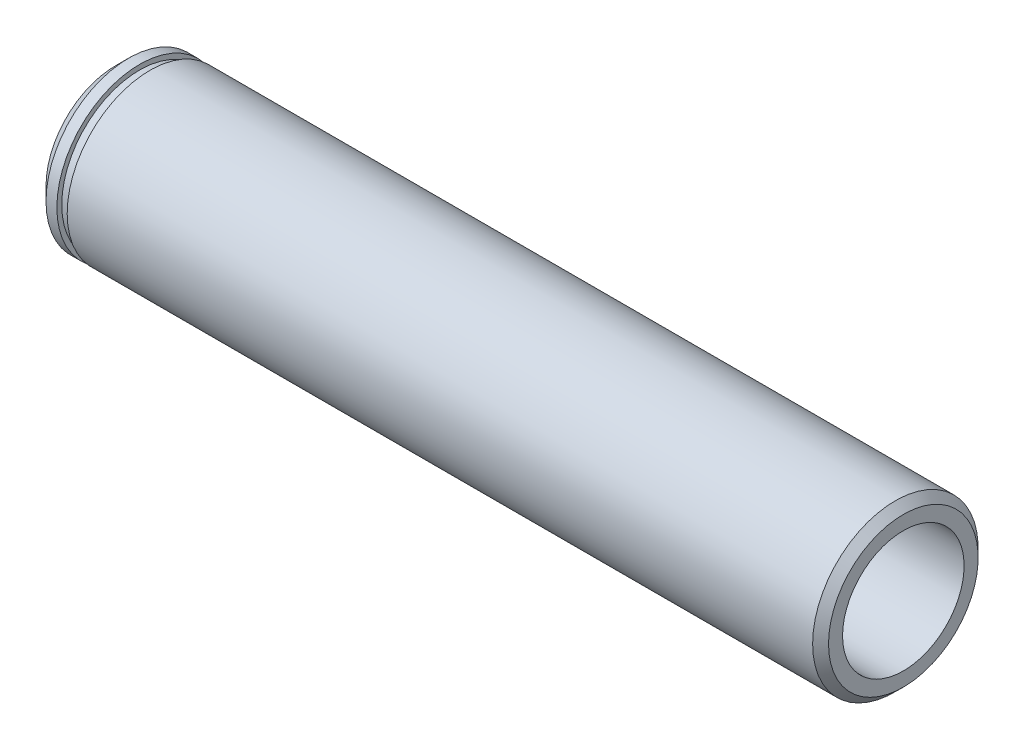
ISO-10303-21;
HEADER;
FILE_DESCRIPTION(('STEP AP214'),'2;1');
FILE_NAME('part.step','',(''),(''),'','','');
FILE_SCHEMA(('AUTOMOTIVE_DESIGN { 1 0 10303 214 1 1 1 1 }'));
ENDSEC;
DATA;
#1=APPLICATION_CONTEXT('core data for automotive mechanical design processes');
#2=APPLICATION_PROTOCOL_DEFINITION('international standard','automotive_design',2000,#1);
#3=PRODUCT_CONTEXT('',#1,'mechanical');
#4=PRODUCT('Part','Part','',(#3));
#5=PRODUCT_RELATED_PRODUCT_CATEGORY('part','',(#4));
#6=PRODUCT_DEFINITION_FORMATION('','',#4);
#7=PRODUCT_DEFINITION_CONTEXT('part definition',#1,'design');
#8=PRODUCT_DEFINITION('design','',#6,#7);
#9=PRODUCT_DEFINITION_SHAPE('','',#8);
#10=(LENGTH_UNIT() NAMED_UNIT(*) SI_UNIT(.MILLI.,.METRE.));
#11=(NAMED_UNIT(*) PLANE_ANGLE_UNIT() SI_UNIT($,.RADIAN.));
#12=(NAMED_UNIT(*) SI_UNIT($,.STERADIAN.) SOLID_ANGLE_UNIT());
#13=UNCERTAINTY_MEASURE_WITH_UNIT(LENGTH_MEASURE(1.E-05),#10,'distance_accuracy_value','');
#14=(GEOMETRIC_REPRESENTATION_CONTEXT(3) GLOBAL_UNCERTAINTY_ASSIGNED_CONTEXT((#13)) GLOBAL_UNIT_ASSIGNED_CONTEXT((#10,
#11,#12)) REPRESENTATION_CONTEXT('',''));
#15=CARTESIAN_POINT('',(0.,0.,0.));
#16=DIRECTION('',(0.,0.,1.));
#17=DIRECTION('',(1.,0.,0.));
#18=AXIS2_PLACEMENT_3D('',#15,#16,#17);
#19=CARTESIAN_POINT('',(75.565,0.,0.));
#20=DIRECTION('',(-1.,0.,0.));
#21=DIRECTION('',(0.,0.,1.));
#22=AXIS2_PLACEMENT_3D('',#19,#20,#21);
#23=CYLINDRICAL_SURFACE('',#22,5.99440000000121);
#24=CARTESIAN_POINT('',(0.,0.,0.));
#25=DIRECTION('',(-1.,0.,0.));
#26=DIRECTION('',(0.,0.,1.));
#27=AXIS2_PLACEMENT_3D('',#24,#25,#26);
#28=CIRCLE('',#27,5.99440000000121);
#29=CARTESIAN_POINT('',(0.,0.,5.99440000000121));
#30=VERTEX_POINT('',#29);
#31=EDGE_CURVE('E10',#30,#30,#28,.T.);
#32=ORIENTED_EDGE('',*,*,#31,.T.);
#33=EDGE_LOOP('',(#32));
#34=FACE_BOUND('',#33,.T.);
#35=CARTESIAN_POINT('',(8.88999999999998,0.,0.));
#36=DIRECTION('',(-1.,0.,0.));
#37=DIRECTION('',(0.,0.,1.));
#38=AXIS2_PLACEMENT_3D('',#35,#36,#37);
#39=CIRCLE('',#38,5.99440000000121);
#40=CARTESIAN_POINT('',(8.88999999999998,0.,5.99440000000121));
#41=VERTEX_POINT('',#40);
#42=EDGE_CURVE('E75',#41,#41,#39,.T.);
#43=ORIENTED_EDGE('',*,*,#42,.F.);
#44=EDGE_LOOP('',(#43));
#45=FACE_BOUND('',#44,.T.);
#46=ADVANCED_FACE('F34',(#34,#45),#23,.F.);
#47=CARTESIAN_POINT('',(-2.39391839684799E-13,5.99440000000121,0.));
#48=DIRECTION('',(-1.,0.,0.));
#49=DIRECTION('',(0.,0.,1.));
#50=AXIS2_PLACEMENT_3D('',#47,#48,#49);
#51=PLANE('',#50);
#52=CARTESIAN_POINT('',(-4.71844785465692E-13,0.,0.));
#53=DIRECTION('',(-1.,0.,0.));
#54=DIRECTION('',(0.,0.,1.));
#55=AXIS2_PLACEMENT_3D('',#52,#53,#54);
#56=CIRCLE('',#55,6.66750000000047);
#57=CARTESIAN_POINT('',(-4.71844785465692E-13,0.,6.66750000000047));
#58=VERTEX_POINT('',#57);
#59=EDGE_CURVE('E40',#58,#58,#56,.T.);
#60=ORIENTED_EDGE('',*,*,#59,.T.);
#61=EDGE_LOOP('',(#60));
#62=FACE_BOUND('',#61,.T.);
#63=ORIENTED_EDGE('',*,*,#31,.F.);
#64=EDGE_LOOP('',(#63));
#65=FACE_BOUND('',#64,.T.);
#66=ADVANCED_FACE('F83',(#62,#65),#51,.T.);
#67=CARTESIAN_POINT('',(-4.71844785465692E-13,0.,0.));
#68=DIRECTION('',(1.,0.,0.));
#69=DIRECTION('',(0.,0.,-1.));
#70=AXIS2_PLACEMENT_3D('',#67,#68,#69);
#71=CONICAL_SURFACE('',#70,6.66750000000047,0.785398163397078);
#72=CARTESIAN_POINT('',(1.26999999999999,0.,0.));
#73=DIRECTION('',(-1.,0.,0.));
#74=DIRECTION('',(0.,0.,1.));
#75=AXIS2_PLACEMENT_3D('',#72,#73,#74);
#76=CIRCLE('',#75,7.9375);
#77=CARTESIAN_POINT('',(1.26999999999999,0.,7.9375));
#78=VERTEX_POINT('',#77);
#79=EDGE_CURVE('E44',#78,#78,#76,.T.);
#80=ORIENTED_EDGE('',*,*,#79,.T.);
#81=EDGE_LOOP('',(#80));
#82=FACE_BOUND('',#81,.T.);
#83=ORIENTED_EDGE('',*,*,#59,.F.);
#84=EDGE_LOOP('',(#83));
#85=FACE_BOUND('',#84,.T.);
#86=ADVANCED_FACE('F87',(#82,#85),#71,.T.);
#87=CARTESIAN_POINT('',(75.565,0.,0.));
#88=DIRECTION('',(-1.,0.,0.));
#89=DIRECTION('',(0.,0.,1.));
#90=AXIS2_PLACEMENT_3D('',#87,#88,#89);
#91=CYLINDRICAL_SURFACE('',#90,7.9375);
#92=CARTESIAN_POINT('',(2.31140000000001,0.,0.));
#93=DIRECTION('',(-1.,0.,0.));
#94=DIRECTION('',(0.,0.,1.));
#95=AXIS2_PLACEMENT_3D('',#92,#93,#94);
#96=CIRCLE('',#95,7.9375);
#97=CARTESIAN_POINT('',(2.31140000000001,0.,7.9375));
#98=VERTEX_POINT('',#97);
#99=EDGE_CURVE('E48',#98,#98,#96,.T.);
#100=ORIENTED_EDGE('',*,*,#99,.T.);
#101=EDGE_LOOP('',(#100));
#102=FACE_BOUND('',#101,.T.);
#103=ORIENTED_EDGE('',*,*,#79,.F.);
#104=EDGE_LOOP('',(#103));
#105=FACE_BOUND('',#104,.T.);
#106=ADVANCED_FACE('F91',(#102,#105),#91,.T.);
#107=CARTESIAN_POINT('',(2.3114,7.9375,0.));
#108=DIRECTION('',(1.,0.,0.));
#109=DIRECTION('',(0.,0.,-1.));
#110=AXIS2_PLACEMENT_3D('',#107,#108,#109);
#111=PLANE('',#110);
#112=CARTESIAN_POINT('',(2.31140000000001,0.,0.));
#113=DIRECTION('',(-1.,0.,0.));
#114=DIRECTION('',(0.,0.,1.));
#115=AXIS2_PLACEMENT_3D('',#112,#113,#114);
#116=CIRCLE('',#115,7.4676);
#117=CARTESIAN_POINT('',(2.31140000000001,0.,7.4676));
#118=VERTEX_POINT('',#117);
#119=EDGE_CURVE('E53',#118,#118,#116,.T.);
#120=ORIENTED_EDGE('',*,*,#119,.T.);
#121=EDGE_LOOP('',(#120));
#122=FACE_BOUND('',#121,.T.);
#123=ORIENTED_EDGE('',*,*,#99,.F.);
#124=EDGE_LOOP('',(#123));
#125=FACE_BOUND('',#124,.T.);
#126=ADVANCED_FACE('F98',(#122,#125),#111,.T.);
#127=CARTESIAN_POINT('',(75.565,0.,0.));
#128=DIRECTION('',(-1.,0.,0.));
#129=DIRECTION('',(0.,0.,1.));
#130=AXIS2_PLACEMENT_3D('',#127,#128,#129);
#131=CYLINDRICAL_SURFACE('',#130,7.4676);
#132=CARTESIAN_POINT('',(3.302,0.,0.));
#133=DIRECTION('',(-1.,0.,0.));
#134=DIRECTION('',(0.,0.,1.));
#135=AXIS2_PLACEMENT_3D('',#132,#133,#134);
#136=CIRCLE('',#135,7.4676);
#137=CARTESIAN_POINT('',(3.302,0.,7.4676));
#138=VERTEX_POINT('',#137);
#139=EDGE_CURVE('E56',#138,#138,#136,.T.);
#140=ORIENTED_EDGE('',*,*,#139,.T.);
#141=EDGE_LOOP('',(#140));
#142=FACE_BOUND('',#141,.T.);
#143=ORIENTED_EDGE('',*,*,#119,.F.);
#144=EDGE_LOOP('',(#143));
#145=FACE_BOUND('',#144,.T.);
#146=ADVANCED_FACE('F102',(#142,#145),#131,.T.);
#147=CARTESIAN_POINT('',(3.302,7.4676,0.));
#148=DIRECTION('',(-1.,0.,0.));
#149=DIRECTION('',(0.,0.,1.));
#150=AXIS2_PLACEMENT_3D('',#147,#148,#149);
#151=PLANE('',#150);
#152=CARTESIAN_POINT('',(3.302,0.,0.));
#153=DIRECTION('',(-1.,0.,0.));
#154=DIRECTION('',(0.,0.,1.));
#155=AXIS2_PLACEMENT_3D('',#152,#153,#154);
#156=CIRCLE('',#155,7.9375);
#157=CARTESIAN_POINT('',(3.302,0.,7.9375));
#158=VERTEX_POINT('',#157);
#159=EDGE_CURVE('E59',#158,#158,#156,.T.);
#160=ORIENTED_EDGE('',*,*,#159,.T.);
#161=EDGE_LOOP('',(#160));
#162=FACE_BOUND('',#161,.T.);
#163=ORIENTED_EDGE('',*,*,#139,.F.);
#164=EDGE_LOOP('',(#163));
#165=FACE_BOUND('',#164,.T.);
#166=ADVANCED_FACE('F106',(#162,#165),#151,.T.);
#167=CARTESIAN_POINT('',(75.565,0.,0.));
#168=DIRECTION('',(-1.,0.,0.));
#169=DIRECTION('',(0.,0.,1.));
#170=AXIS2_PLACEMENT_3D('',#167,#168,#169);
#171=CYLINDRICAL_SURFACE('',#170,7.9375);
#172=CARTESIAN_POINT('',(74.803,0.,0.));
#173=DIRECTION('',(-1.,0.,0.));
#174=DIRECTION('',(0.,0.,1.));
#175=AXIS2_PLACEMENT_3D('',#172,#173,#174);
#176=CIRCLE('',#175,7.9375);
#177=CARTESIAN_POINT('',(74.803,0.,7.9375));
#178=VERTEX_POINT('',#177);
#179=EDGE_CURVE('E62',#178,#178,#176,.T.);
#180=ORIENTED_EDGE('',*,*,#179,.T.);
#181=EDGE_LOOP('',(#180));
#182=FACE_BOUND('',#181,.T.);
#183=ORIENTED_EDGE('',*,*,#159,.F.);
#184=EDGE_LOOP('',(#183));
#185=FACE_BOUND('',#184,.T.);
#186=ADVANCED_FACE('F110',(#182,#185),#171,.T.);
#187=CARTESIAN_POINT('',(74.803,0.,0.));
#188=DIRECTION('',(-1.,0.,0.));
#189=DIRECTION('',(0.,0.,1.));
#190=AXIS2_PLACEMENT_3D('',#187,#188,#189);
#191=CONICAL_SURFACE('',#190,7.9375,0.785398163397452);
#192=CARTESIAN_POINT('',(75.565,0.,0.));
#193=DIRECTION('',(-1.,0.,0.));
#194=DIRECTION('',(0.,0.,1.));
#195=AXIS2_PLACEMENT_3D('',#192,#193,#194);
#196=CIRCLE('',#195,7.17550000000001);
#197=CARTESIAN_POINT('',(75.565,0.,7.17550000000001));
#198=VERTEX_POINT('',#197);
#199=EDGE_CURVE('E66',#198,#198,#196,.T.);
#200=ORIENTED_EDGE('',*,*,#199,.T.);
#201=EDGE_LOOP('',(#200));
#202=FACE_BOUND('',#201,.T.);
#203=ORIENTED_EDGE('',*,*,#179,.F.);
#204=EDGE_LOOP('',(#203));
#205=FACE_BOUND('',#204,.T.);
#206=ADVANCED_FACE('F114',(#202,#205),#191,.T.);
#207=CARTESIAN_POINT('',(75.565,7.17550000000001,0.));
#208=DIRECTION('',(1.,0.,0.));
#209=DIRECTION('',(0.,0.,-1.));
#210=AXIS2_PLACEMENT_3D('',#207,#208,#209);
#211=PLANE('',#210);
#212=CARTESIAN_POINT('',(75.565,0.,0.));
#213=DIRECTION('',(-1.,0.,0.));
#214=DIRECTION('',(0.,0.,1.));
#215=AXIS2_PLACEMENT_3D('',#212,#213,#214);
#216=CIRCLE('',#215,5.82930000000121);
#217=CARTESIAN_POINT('',(75.565,0.,5.82930000000121));
#218=VERTEX_POINT('',#217);
#219=EDGE_CURVE('E69',#218,#218,#216,.T.);
#220=ORIENTED_EDGE('',*,*,#219,.T.);
#221=EDGE_LOOP('',(#220));
#222=FACE_BOUND('',#221,.T.);
#223=ORIENTED_EDGE('',*,*,#199,.F.);
#224=EDGE_LOOP('',(#223));
#225=FACE_BOUND('',#224,.T.);
#226=ADVANCED_FACE('F118',(#222,#225),#211,.T.);
#227=CARTESIAN_POINT('',(75.565,0.,0.));
#228=DIRECTION('',(-1.,0.,0.));
#229=DIRECTION('',(0.,0.,1.));
#230=AXIS2_PLACEMENT_3D('',#227,#228,#229);
#231=CYLINDRICAL_SURFACE('',#230,5.82930000000121);
#232=CARTESIAN_POINT('',(8.88999999999998,0.,0.));
#233=DIRECTION('',(-1.,0.,0.));
#234=DIRECTION('',(0.,0.,1.));
#235=AXIS2_PLACEMENT_3D('',#232,#233,#234);
#236=CIRCLE('',#235,5.82930000000121);
#237=CARTESIAN_POINT('',(8.88999999999998,0.,5.82930000000121));
#238=VERTEX_POINT('',#237);
#239=EDGE_CURVE('E72',#238,#238,#236,.T.);
#240=ORIENTED_EDGE('',*,*,#239,.T.);
#241=EDGE_LOOP('',(#240));
#242=FACE_BOUND('',#241,.T.);
#243=ORIENTED_EDGE('',*,*,#219,.F.);
#244=EDGE_LOOP('',(#243));
#245=FACE_BOUND('',#244,.T.);
#246=ADVANCED_FACE('F122',(#242,#245),#231,.F.);
#247=CARTESIAN_POINT('',(8.88999999999998,5.82930000000121,0.));
#248=DIRECTION('',(-1.,0.,0.));
#249=DIRECTION('',(0.,0.,1.));
#250=AXIS2_PLACEMENT_3D('',#247,#248,#249);
#251=PLANE('',#250);
#252=ORIENTED_EDGE('',*,*,#42,.T.);
#253=EDGE_LOOP('',(#252));
#254=FACE_BOUND('',#253,.T.);
#255=ORIENTED_EDGE('',*,*,#239,.F.);
#256=EDGE_LOOP('',(#255));
#257=FACE_BOUND('',#256,.T.);
#258=ADVANCED_FACE('F79',(#254,#257),#251,.T.);
#259=CLOSED_SHELL('',(#46,#66,#86,#106,#126,#146,#166,#186,#206,#226,#246,#258));
#260=MANIFOLD_SOLID_BREP('B2',#259);
#261=ADVANCED_BREP_SHAPE_REPRESENTATION('',(#18,#260),#14);
#262=SHAPE_DEFINITION_REPRESENTATION(#9,#261);
ENDSEC;
END-ISO-10303-21;
